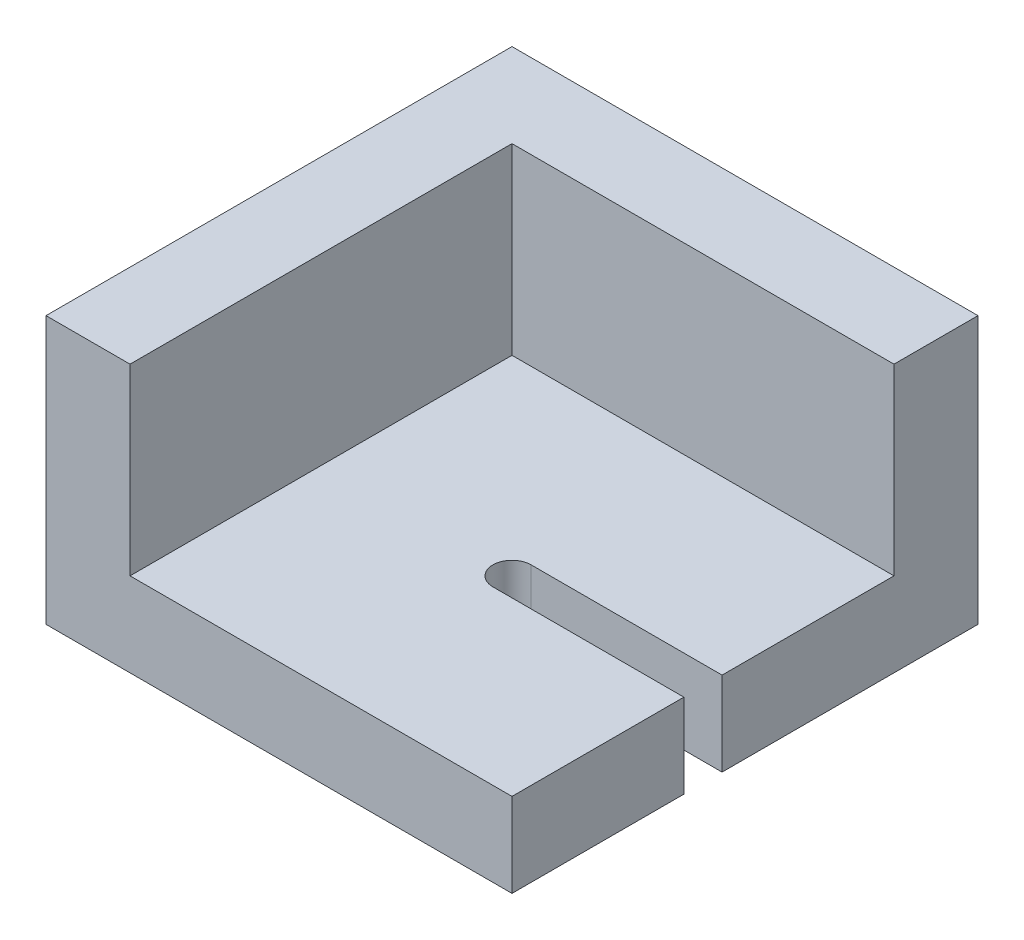
ISO-10303-21;
HEADER;
FILE_DESCRIPTION(('STEP AP214'),'2;1');
FILE_NAME('part.step','',(''),(''),'','','');
FILE_SCHEMA(('AUTOMOTIVE_DESIGN { 1 0 10303 214 1 1 1 1 }'));
ENDSEC;
DATA;
#1=APPLICATION_CONTEXT('core data for automotive mechanical design processes');
#2=APPLICATION_PROTOCOL_DEFINITION('international standard','automotive_design',2000,#1);
#3=PRODUCT_CONTEXT('',#1,'mechanical');
#4=PRODUCT('Part','Part','',(#3));
#5=PRODUCT_RELATED_PRODUCT_CATEGORY('part','',(#4));
#6=PRODUCT_DEFINITION_FORMATION('','',#4);
#7=PRODUCT_DEFINITION_CONTEXT('part definition',#1,'design');
#8=PRODUCT_DEFINITION('design','',#6,#7);
#9=PRODUCT_DEFINITION_SHAPE('','',#8);
#10=(LENGTH_UNIT() NAMED_UNIT(*) SI_UNIT(.MILLI.,.METRE.));
#11=(NAMED_UNIT(*) PLANE_ANGLE_UNIT() SI_UNIT($,.RADIAN.));
#12=(NAMED_UNIT(*) SI_UNIT($,.STERADIAN.) SOLID_ANGLE_UNIT());
#13=UNCERTAINTY_MEASURE_WITH_UNIT(LENGTH_MEASURE(1.E-05),#10,'distance_accuracy_value','');
#14=(GEOMETRIC_REPRESENTATION_CONTEXT(3) GLOBAL_UNCERTAINTY_ASSIGNED_CONTEXT((#13)) GLOBAL_UNIT_ASSIGNED_CONTEXT((#10,
#11,#12)) REPRESENTATION_CONTEXT('',''));
#15=CARTESIAN_POINT('',(0.,0.,0.));
#16=DIRECTION('',(0.,0.,1.));
#17=DIRECTION('',(1.,0.,0.));
#18=AXIS2_PLACEMENT_3D('',#15,#16,#17);
#19=CARTESIAN_POINT('',(-0.0100000000000033,70.,-0.0100000000000033));
#20=DIRECTION('',(0.,1.,0.));
#21=DIRECTION('',(0.,0.,1.));
#22=AXIS2_PLACEMENT_3D('',#19,#20,#21);
#23=PLANE('',#22);
#24=DIRECTION('',(0.,0.,-1.));
#25=VECTOR('',#24,1.);
#26=CARTESIAN_POINT('',(0.,70.,61.));
#27=LINE('',#26,#25);
#28=CARTESIAN_POINT('',(0.,70.,122.));
#29=VERTEX_POINT('',#28);
#30=CARTESIAN_POINT('',(0.,70.,0.));
#31=VERTEX_POINT('',#30);
#32=EDGE_CURVE('E211',#29,#31,#27,.T.);
#33=ORIENTED_EDGE('',*,*,#32,.F.);
#34=DIRECTION('',(-1.,0.,0.));
#35=VECTOR('',#34,1.);
#36=CARTESIAN_POINT('',(61.,70.,122.));
#37=LINE('',#36,#35);
#38=CARTESIAN_POINT('',(22.,70.,122.));
#39=VERTEX_POINT('',#38);
#40=EDGE_CURVE('E155',#39,#29,#37,.T.);
#41=ORIENTED_EDGE('',*,*,#40,.F.);
#42=DIRECTION('',(0.,0.,1.));
#43=VECTOR('',#42,1.);
#44=CARTESIAN_POINT('',(22.,70.,72.));
#45=LINE('',#44,#43);
#46=CARTESIAN_POINT('',(22.,70.,22.));
#47=VERTEX_POINT('',#46);
#48=EDGE_CURVE('E156',#47,#39,#45,.T.);
#49=ORIENTED_EDGE('',*,*,#48,.F.);
#50=DIRECTION('',(-1.,0.,0.));
#51=VECTOR('',#50,1.);
#52=CARTESIAN_POINT('',(72.,70.,22.));
#53=LINE('',#52,#51);
#54=CARTESIAN_POINT('',(122.,70.,22.));
#55=VERTEX_POINT('',#54);
#56=EDGE_CURVE('E167',#55,#47,#53,.T.);
#57=ORIENTED_EDGE('',*,*,#56,.F.);
#58=DIRECTION('',(0.,0.,1.));
#59=VECTOR('',#58,1.);
#60=CARTESIAN_POINT('',(122.,70.,33.5));
#61=LINE('',#60,#59);
#62=CARTESIAN_POINT('',(122.,70.,0.));
#63=VERTEX_POINT('',#62);
#64=EDGE_CURVE('E178',#63,#55,#61,.T.);
#65=ORIENTED_EDGE('',*,*,#64,.F.);
#66=DIRECTION('',(1.,0.,0.));
#67=VECTOR('',#66,1.);
#68=CARTESIAN_POINT('',(61.,70.,0.));
#69=LINE('',#68,#67);
#70=EDGE_CURVE('E189',#31,#63,#69,.T.);
#71=ORIENTED_EDGE('',*,*,#70,.F.);
#72=EDGE_LOOP('',(#33,#41,#49,#57,#65,#71));
#73=FACE_BOUND('',#72,.T.);
#74=ADVANCED_FACE('F17',(#73),#23,.T.);
#75=CARTESIAN_POINT('',(0.,-0.01,-0.01));
#76=DIRECTION('',(-1.,0.,0.));
#77=DIRECTION('',(0.,0.,1.));
#78=AXIS2_PLACEMENT_3D('',#75,#76,#77);
#79=PLANE('',#78);
#80=ORIENTED_EDGE('',*,*,#32,.T.);
#81=DIRECTION('',(0.,1.,0.));
#82=VECTOR('',#81,1.);
#83=CARTESIAN_POINT('',(0.,35.,0.));
#84=LINE('',#83,#82);
#85=CARTESIAN_POINT('',(0.,0.,0.));
#86=VERTEX_POINT('',#85);
#87=EDGE_CURVE('E208',#86,#31,#84,.T.);
#88=ORIENTED_EDGE('',*,*,#87,.F.);
#89=DIRECTION('',(0.,0.,-1.));
#90=VECTOR('',#89,1.);
#91=CARTESIAN_POINT('',(0.,0.,61.));
#92=LINE('',#91,#90);
#93=CARTESIAN_POINT('',(0.,0.,122.));
#94=VERTEX_POINT('',#93);
#95=EDGE_CURVE('E141',#94,#86,#92,.T.);
#96=ORIENTED_EDGE('',*,*,#95,.F.);
#97=DIRECTION('',(0.,-1.,0.));
#98=VECTOR('',#97,1.);
#99=CARTESIAN_POINT('',(0.,35.,122.));
#100=LINE('',#99,#98);
#101=EDGE_CURVE('E142',#29,#94,#100,.T.);
#102=ORIENTED_EDGE('',*,*,#101,.F.);
#103=EDGE_LOOP('',(#80,#88,#96,#102));
#104=FACE_BOUND('',#103,.T.);
#105=ADVANCED_FACE('F269',(#104),#79,.T.);
#106=CARTESIAN_POINT('',(122.01,-0.01,0.));
#107=DIRECTION('',(0.,0.,-1.));
#108=DIRECTION('',(-1.,0.,0.));
#109=AXIS2_PLACEMENT_3D('',#106,#107,#108);
#110=PLANE('',#109);
#111=ORIENTED_EDGE('',*,*,#70,.T.);
#112=DIRECTION('',(0.,1.,0.));
#113=VECTOR('',#112,1.);
#114=CARTESIAN_POINT('',(122.,35.,0.));
#115=LINE('',#114,#113);
#116=CARTESIAN_POINT('',(122.,0.,0.));
#117=VERTEX_POINT('',#116);
#118=EDGE_CURVE('E188',#117,#63,#115,.T.);
#119=ORIENTED_EDGE('',*,*,#118,.F.);
#120=DIRECTION('',(1.,0.,0.));
#121=VECTOR('',#120,1.);
#122=CARTESIAN_POINT('',(61.,0.,0.));
#123=LINE('',#122,#121);
#124=EDGE_CURVE('E197',#86,#117,#123,.T.);
#125=ORIENTED_EDGE('',*,*,#124,.F.);
#126=ORIENTED_EDGE('',*,*,#87,.T.);
#127=EDGE_LOOP('',(#111,#119,#125,#126));
#128=FACE_BOUND('',#127,.T.);
#129=ADVANCED_FACE('F272',(#128),#110,.T.);
#130=CARTESIAN_POINT('',(122.01,22.01,67.));
#131=DIRECTION('',(0.,0.,1.));
#132=DIRECTION('',(-1.,0.,0.));
#133=AXIS2_PLACEMENT_3D('',#130,#131,#132);
#134=PLANE('',#133);
#135=DIRECTION('',(1.,0.,0.));
#136=VECTOR('',#135,1.);
#137=CARTESIAN_POINT('',(72.,22.,67.));
#138=LINE('',#137,#136);
#139=CARTESIAN_POINT('',(72.,22.,67.));
#140=VERTEX_POINT('',#139);
#141=CARTESIAN_POINT('',(122.,22.,67.));
#142=VERTEX_POINT('',#141);
#143=EDGE_CURVE('E183',#140,#142,#138,.T.);
#144=ORIENTED_EDGE('',*,*,#143,.F.);
#145=DIRECTION('',(0.,1.,0.));
#146=VECTOR('',#145,1.);
#147=CARTESIAN_POINT('',(72.,11.,67.));
#148=LINE('',#147,#146);
#149=CARTESIAN_POINT('',(72.,0.,67.));
#150=VERTEX_POINT('',#149);
#151=EDGE_CURVE('E192',#150,#140,#148,.T.);
#152=ORIENTED_EDGE('',*,*,#151,.F.);
#153=DIRECTION('',(-1.,0.,0.));
#154=VECTOR('',#153,1.);
#155=CARTESIAN_POINT('',(61.,0.,67.));
#156=LINE('',#155,#154);
#157=CARTESIAN_POINT('',(122.,0.,67.));
#158=VERTEX_POINT('',#157);
#159=EDGE_CURVE('E132',#158,#150,#156,.T.);
#160=ORIENTED_EDGE('',*,*,#159,.F.);
#161=DIRECTION('',(0.,-1.,0.));
#162=VECTOR('',#161,1.);
#163=CARTESIAN_POINT('',(122.,35.,67.));
#164=LINE('',#163,#162);
#165=EDGE_CURVE('E186',#142,#158,#164,.T.);
#166=ORIENTED_EDGE('',*,*,#165,.F.);
#167=EDGE_LOOP('',(#144,#152,#160,#166));
#168=FACE_BOUND('',#167,.T.);
#169=ADVANCED_FACE('F247',(#168),#134,.T.);
#170=CARTESIAN_POINT('',(122.,-0.01,67.01));
#171=DIRECTION('',(1.,0.,0.));
#172=DIRECTION('',(0.,0.,-1.));
#173=AXIS2_PLACEMENT_3D('',#170,#171,#172);
#174=PLANE('',#173);
#175=DIRECTION('',(0.,1.,0.));
#176=VECTOR('',#175,1.);
#177=CARTESIAN_POINT('',(122.,46.,22.));
#178=LINE('',#177,#176);
#179=CARTESIAN_POINT('',(122.,22.,22.));
#180=VERTEX_POINT('',#179);
#181=EDGE_CURVE('E175',#180,#55,#178,.T.);
#182=ORIENTED_EDGE('',*,*,#181,.F.);
#183=DIRECTION('',(0.,0.,-1.));
#184=VECTOR('',#183,1.);
#185=CARTESIAN_POINT('',(122.,22.,72.));
#186=LINE('',#185,#184);
#187=EDGE_CURVE('E172',#142,#180,#186,.T.);
#188=ORIENTED_EDGE('',*,*,#187,.F.);
#189=ORIENTED_EDGE('',*,*,#165,.T.);
#190=DIRECTION('',(0.,0.,1.));
#191=VECTOR('',#190,1.);
#192=CARTESIAN_POINT('',(122.,0.,61.));
#193=LINE('',#192,#191);
#194=EDGE_CURVE('E134',#117,#158,#193,.T.);
#195=ORIENTED_EDGE('',*,*,#194,.F.);
#196=ORIENTED_EDGE('',*,*,#118,.T.);
#197=ORIENTED_EDGE('',*,*,#64,.T.);
#198=EDGE_LOOP('',(#182,#188,#189,#195,#196,#197));
#199=FACE_BOUND('',#198,.T.);
#200=ADVANCED_FACE('F251',(#199),#174,.T.);
#201=CARTESIAN_POINT('',(21.99,21.99,22.));
#202=DIRECTION('',(0.,0.,1.));
#203=DIRECTION('',(1.,0.,0.));
#204=AXIS2_PLACEMENT_3D('',#201,#202,#203);
#205=PLANE('',#204);
#206=ORIENTED_EDGE('',*,*,#56,.T.);
#207=DIRECTION('',(0.,1.,0.));
#208=VECTOR('',#207,1.);
#209=CARTESIAN_POINT('',(22.,46.,22.));
#210=LINE('',#209,#208);
#211=CARTESIAN_POINT('',(22.,22.,22.));
#212=VERTEX_POINT('',#211);
#213=EDGE_CURVE('E164',#212,#47,#210,.T.);
#214=ORIENTED_EDGE('',*,*,#213,.F.);
#215=DIRECTION('',(-1.,0.,0.));
#216=VECTOR('',#215,1.);
#217=CARTESIAN_POINT('',(72.,22.,22.));
#218=LINE('',#217,#216);
#219=EDGE_CURVE('E161',#180,#212,#218,.T.);
#220=ORIENTED_EDGE('',*,*,#219,.F.);
#221=ORIENTED_EDGE('',*,*,#181,.T.);
#222=EDGE_LOOP('',(#206,#214,#220,#221));
#223=FACE_BOUND('',#222,.T.);
#224=ADVANCED_FACE('F256',(#223),#205,.T.);
#225=CARTESIAN_POINT('',(22.,21.99,122.01));
#226=DIRECTION('',(1.,0.,0.));
#227=DIRECTION('',(0.,0.,-1.));
#228=AXIS2_PLACEMENT_3D('',#225,#226,#227);
#229=PLANE('',#228);
#230=ORIENTED_EDGE('',*,*,#48,.T.);
#231=DIRECTION('',(0.,1.,0.));
#232=VECTOR('',#231,1.);
#233=CARTESIAN_POINT('',(22.,35.,122.));
#234=LINE('',#233,#232);
#235=CARTESIAN_POINT('',(22.,22.,122.));
#236=VERTEX_POINT('',#235);
#237=EDGE_CURVE('E152',#236,#39,#234,.T.);
#238=ORIENTED_EDGE('',*,*,#237,.F.);
#239=DIRECTION('',(0.,0.,1.));
#240=VECTOR('',#239,1.);
#241=CARTESIAN_POINT('',(22.,22.,72.));
#242=LINE('',#241,#240);
#243=EDGE_CURVE('E149',#212,#236,#242,.T.);
#244=ORIENTED_EDGE('',*,*,#243,.F.);
#245=ORIENTED_EDGE('',*,*,#213,.T.);
#246=EDGE_LOOP('',(#230,#238,#244,#245));
#247=FACE_BOUND('',#246,.T.);
#248=ADVANCED_FACE('F260',(#247),#229,.T.);
#249=CARTESIAN_POINT('',(-0.01,-0.01,122.));
#250=DIRECTION('',(0.,0.,1.));
#251=DIRECTION('',(1.,0.,0.));
#252=AXIS2_PLACEMENT_3D('',#249,#250,#251);
#253=PLANE('',#252);
#254=ORIENTED_EDGE('',*,*,#40,.T.);
#255=ORIENTED_EDGE('',*,*,#101,.T.);
#256=DIRECTION('',(-1.,0.,0.));
#257=VECTOR('',#256,1.);
#258=CARTESIAN_POINT('',(61.,0.,122.));
#259=LINE('',#258,#257);
#260=CARTESIAN_POINT('',(122.,0.,122.));
#261=VERTEX_POINT('',#260);
#262=EDGE_CURVE('E139',#261,#94,#259,.T.);
#263=ORIENTED_EDGE('',*,*,#262,.F.);
#264=DIRECTION('',(0.,-1.,0.));
#265=VECTOR('',#264,1.);
#266=CARTESIAN_POINT('',(122.,11.,122.));
#267=LINE('',#266,#265);
#268=CARTESIAN_POINT('',(122.,22.,122.));
#269=VERTEX_POINT('',#268);
#270=EDGE_CURVE('E115',#269,#261,#267,.T.);
#271=ORIENTED_EDGE('',*,*,#270,.F.);
#272=DIRECTION('',(1.,0.,0.));
#273=VECTOR('',#272,1.);
#274=CARTESIAN_POINT('',(72.,22.,122.));
#275=LINE('',#274,#273);
#276=EDGE_CURVE('E127',#236,#269,#275,.T.);
#277=ORIENTED_EDGE('',*,*,#276,.F.);
#278=ORIENTED_EDGE('',*,*,#237,.T.);
#279=EDGE_LOOP('',(#254,#255,#263,#271,#277,#278));
#280=FACE_BOUND('',#279,.T.);
#281=ADVANCED_FACE('F264',(#280),#253,.T.);
#282=CARTESIAN_POINT('',(122.01,0.,122.01));
#283=DIRECTION('',(0.,-1.,0.));
#284=DIRECTION('',(-1.,0.,0.));
#285=AXIS2_PLACEMENT_3D('',#282,#283,#284);
#286=PLANE('',#285);
#287=ORIENTED_EDGE('',*,*,#159,.T.);
#288=CARTESIAN_POINT('',(72.,0.,72.));
#289=DIRECTION('',(0.,-1.,0.));
#290=DIRECTION('',(0.,0.,-1.));
#291=AXIS2_PLACEMENT_3D('',#288,#289,#290);
#292=CIRCLE('',#291,5.);
#293=CARTESIAN_POINT('',(72.,0.,77.));
#294=VERTEX_POINT('',#293);
#295=EDGE_CURVE('E21',#294,#150,#292,.T.);
#296=ORIENTED_EDGE('',*,*,#295,.F.);
#297=DIRECTION('',(-1.,0.,0.));
#298=VECTOR('',#297,1.);
#299=CARTESIAN_POINT('',(97.,0.,77.));
#300=LINE('',#299,#298);
#301=CARTESIAN_POINT('',(122.,0.,77.));
#302=VERTEX_POINT('',#301);
#303=EDGE_CURVE('E101',#302,#294,#300,.T.);
#304=ORIENTED_EDGE('',*,*,#303,.F.);
#305=DIRECTION('',(0.,0.,-1.));
#306=VECTOR('',#305,1.);
#307=CARTESIAN_POINT('',(122.,0.,99.5));
#308=LINE('',#307,#306);
#309=EDGE_CURVE('E105',#261,#302,#308,.T.);
#310=ORIENTED_EDGE('',*,*,#309,.F.);
#311=ORIENTED_EDGE('',*,*,#262,.T.);
#312=ORIENTED_EDGE('',*,*,#95,.T.);
#313=ORIENTED_EDGE('',*,*,#124,.T.);
#314=ORIENTED_EDGE('',*,*,#194,.T.);
#315=EDGE_LOOP('',(#287,#296,#304,#310,#311,#312,#313,#314));
#316=FACE_BOUND('',#315,.T.);
#317=ADVANCED_FACE('F103',(#316),#286,.T.);
#318=CARTESIAN_POINT('',(72.,22.,72.));
#319=DIRECTION('',(0.,-1.,0.));
#320=DIRECTION('',(0.,0.,-1.));
#321=AXIS2_PLACEMENT_3D('',#318,#319,#320);
#322=CYLINDRICAL_SURFACE('',#321,5.);
#323=CARTESIAN_POINT('',(72.,22.,72.));
#324=DIRECTION('',(0.,-1.,0.));
#325=DIRECTION('',(0.,0.,-1.));
#326=AXIS2_PLACEMENT_3D('',#323,#324,#325);
#327=CIRCLE('',#326,5.);
#328=CARTESIAN_POINT('',(72.,22.,77.));
#329=VERTEX_POINT('',#328);
#330=EDGE_CURVE('E194',#329,#140,#327,.T.);
#331=ORIENTED_EDGE('',*,*,#330,.F.);
#332=DIRECTION('',(0.,1.,0.));
#333=VECTOR('',#332,1.);
#334=CARTESIAN_POINT('',(72.,11.,77.));
#335=LINE('',#334,#333);
#336=EDGE_CURVE('E109',#294,#329,#335,.T.);
#337=ORIENTED_EDGE('',*,*,#336,.F.);
#338=ORIENTED_EDGE('',*,*,#295,.T.);
#339=ORIENTED_EDGE('',*,*,#151,.T.);
#340=EDGE_LOOP('',(#331,#337,#338,#339));
#341=FACE_BOUND('',#340,.T.);
#342=ADVANCED_FACE('F288',(#341),#322,.F.);
#343=CARTESIAN_POINT('',(21.99,22.,21.99));
#344=DIRECTION('',(0.,1.,0.));
#345=DIRECTION('',(0.,0.,1.));
#346=AXIS2_PLACEMENT_3D('',#343,#344,#345);
#347=PLANE('',#346);
#348=ORIENTED_EDGE('',*,*,#276,.T.);
#349=DIRECTION('',(0.,0.,1.));
#350=VECTOR('',#349,1.);
#351=CARTESIAN_POINT('',(122.,22.,99.5));
#352=LINE('',#351,#350);
#353=CARTESIAN_POINT('',(122.,22.,77.));
#354=VERTEX_POINT('',#353);
#355=EDGE_CURVE('E36',#354,#269,#352,.T.);
#356=ORIENTED_EDGE('',*,*,#355,.F.);
#357=DIRECTION('',(1.,0.,0.));
#358=VECTOR('',#357,1.);
#359=CARTESIAN_POINT('',(97.,22.,77.));
#360=LINE('',#359,#358);
#361=EDGE_CURVE('E27',#329,#354,#360,.T.);
#362=ORIENTED_EDGE('',*,*,#361,.F.);
#363=ORIENTED_EDGE('',*,*,#330,.T.);
#364=ORIENTED_EDGE('',*,*,#143,.T.);
#365=ORIENTED_EDGE('',*,*,#187,.T.);
#366=ORIENTED_EDGE('',*,*,#219,.T.);
#367=ORIENTED_EDGE('',*,*,#243,.T.);
#368=EDGE_LOOP('',(#348,#356,#362,#363,#364,#365,#366,#367));
#369=FACE_BOUND('',#368,.T.);
#370=ADVANCED_FACE('F243',(#369),#347,.T.);
#371=CARTESIAN_POINT('',(122.,-0.01,122.01));
#372=DIRECTION('',(1.,0.,0.));
#373=DIRECTION('',(0.,0.,-1.));
#374=AXIS2_PLACEMENT_3D('',#371,#372,#373);
#375=PLANE('',#374);
#376=ORIENTED_EDGE('',*,*,#270,.T.);
#377=ORIENTED_EDGE('',*,*,#309,.T.);
#378=DIRECTION('',(0.,-1.,0.));
#379=VECTOR('',#378,1.);
#380=CARTESIAN_POINT('',(122.,11.,77.));
#381=LINE('',#380,#379);
#382=EDGE_CURVE('E11',#354,#302,#381,.T.);
#383=ORIENTED_EDGE('',*,*,#382,.F.);
#384=ORIENTED_EDGE('',*,*,#355,.T.);
#385=EDGE_LOOP('',(#376,#377,#383,#384));
#386=FACE_BOUND('',#385,.T.);
#387=ADVANCED_FACE('F112',(#386),#375,.T.);
#388=CARTESIAN_POINT('',(71.99,22.01,77.));
#389=DIRECTION('',(0.,0.,-1.));
#390=DIRECTION('',(1.,0.,0.));
#391=AXIS2_PLACEMENT_3D('',#388,#389,#390);
#392=PLANE('',#391);
#393=ORIENTED_EDGE('',*,*,#361,.T.);
#394=ORIENTED_EDGE('',*,*,#382,.T.);
#395=ORIENTED_EDGE('',*,*,#303,.T.);
#396=ORIENTED_EDGE('',*,*,#336,.T.);
#397=EDGE_LOOP('',(#393,#394,#395,#396));
#398=FACE_BOUND('',#397,.T.);
#399=ADVANCED_FACE('F19',(#398),#392,.T.);
#400=CLOSED_SHELL('',(#74,#105,#129,#169,#200,#224,#248,#281,#317,#342,#370,#387,#399));
#401=MANIFOLD_SOLID_BREP('B1',#400);
#402=ADVANCED_BREP_SHAPE_REPRESENTATION('',(#18,#401),#14);
#403=SHAPE_DEFINITION_REPRESENTATION(#9,#402);
ENDSEC;
END-ISO-10303-21;
